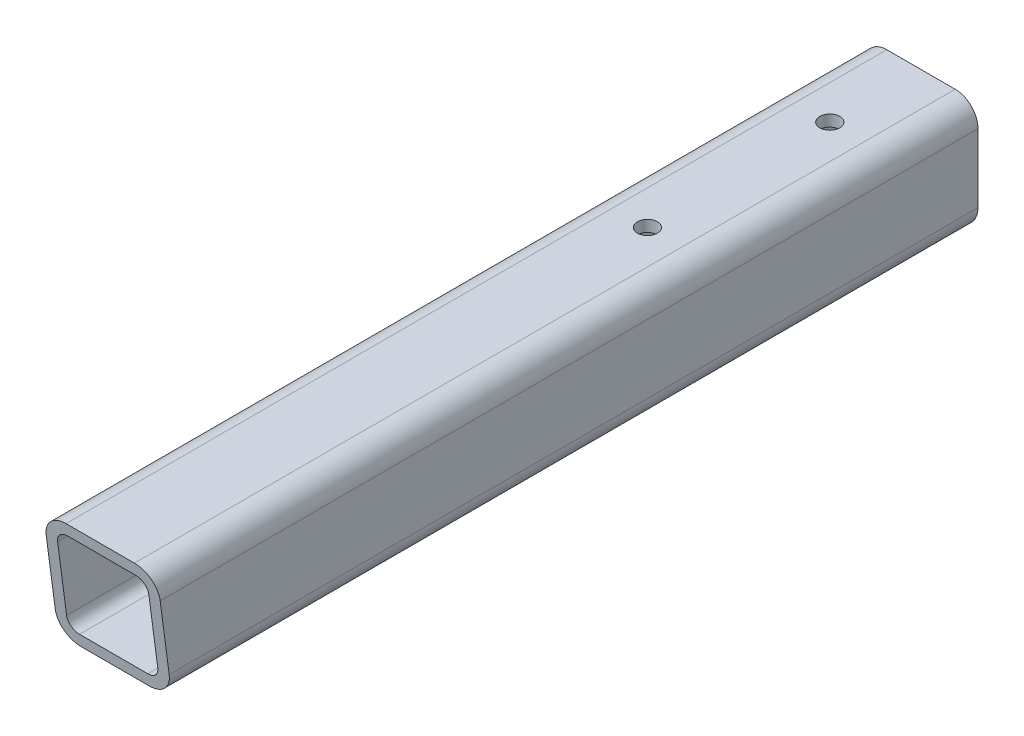
ISO-10303-21;
HEADER;
FILE_DESCRIPTION(('STEP AP214'),'2;1');
FILE_NAME('part.step','',(''),(''),'','','');
FILE_SCHEMA(('AUTOMOTIVE_DESIGN { 1 0 10303 214 1 1 1 1 }'));
ENDSEC;
DATA;
#1=APPLICATION_CONTEXT('core data for automotive mechanical design processes');
#2=APPLICATION_PROTOCOL_DEFINITION('international standard','automotive_design',2000,#1);
#3=PRODUCT_CONTEXT('',#1,'mechanical');
#4=PRODUCT('Part','Part','',(#3));
#5=PRODUCT_RELATED_PRODUCT_CATEGORY('part','',(#4));
#6=PRODUCT_DEFINITION_FORMATION('','',#4);
#7=PRODUCT_DEFINITION_CONTEXT('part definition',#1,'design');
#8=PRODUCT_DEFINITION('design','',#6,#7);
#9=PRODUCT_DEFINITION_SHAPE('','',#8);
#10=(LENGTH_UNIT() NAMED_UNIT(*) SI_UNIT(.MILLI.,.METRE.));
#11=(NAMED_UNIT(*) PLANE_ANGLE_UNIT() SI_UNIT($,.RADIAN.));
#12=(NAMED_UNIT(*) SI_UNIT($,.STERADIAN.) SOLID_ANGLE_UNIT());
#13=UNCERTAINTY_MEASURE_WITH_UNIT(LENGTH_MEASURE(1.E-05),#10,'distance_accuracy_value','');
#14=(GEOMETRIC_REPRESENTATION_CONTEXT(3) GLOBAL_UNCERTAINTY_ASSIGNED_CONTEXT((#13)) GLOBAL_UNIT_ASSIGNED_CONTEXT((#10,
#11,#12)) REPRESENTATION_CONTEXT('',''));
#15=CARTESIAN_POINT('',(0.,0.,0.));
#16=DIRECTION('',(0.,0.,1.));
#17=DIRECTION('',(1.,0.,0.));
#18=AXIS2_PLACEMENT_3D('',#15,#16,#17);
#19=CARTESIAN_POINT('',(0.,31.75,228.6));
#20=DIRECTION('',(0.,-1.,0.));
#21=DIRECTION('',(1.,0.,0.));
#22=AXIS2_PLACEMENT_3D('',#19,#20,#21);
#23=PLANE('',#22);
#24=CARTESIAN_POINT('',(0.,31.75,-76.2));
#25=DIRECTION('',(0.,1.,0.));
#26=DIRECTION('',(-1.,0.,0.));
#27=AXIS2_PLACEMENT_3D('',#24,#25,#26);
#28=CIRCLE('',#27,5.55625);
#29=CARTESIAN_POINT('',(-5.55625000000002,31.75,-76.2));
#30=VERTEX_POINT('',#29);
#31=EDGE_CURVE('E325',#30,#30,#28,.T.);
#32=ORIENTED_EDGE('',*,*,#31,.F.);
#33=EDGE_LOOP('',(#32));
#34=FACE_BOUND('',#33,.T.);
#35=CARTESIAN_POINT('',(0.,31.75,-177.8));
#36=DIRECTION('',(0.,1.,0.));
#37=DIRECTION('',(-1.,0.,0.));
#38=AXIS2_PLACEMENT_3D('',#35,#36,#37);
#39=CIRCLE('',#38,5.55625);
#40=CARTESIAN_POINT('',(-5.55625000000002,31.75,-177.8));
#41=VERTEX_POINT('',#40);
#42=EDGE_CURVE('E229',#41,#41,#39,.T.);
#43=ORIENTED_EDGE('',*,*,#42,.F.);
#44=EDGE_LOOP('',(#43));
#45=FACE_BOUND('',#44,.T.);
#46=DIRECTION('',(-1.,0.,0.));
#47=VECTOR('',#46,1.);
#48=CARTESIAN_POINT('',(0.,31.75,-228.6));
#49=LINE('',#48,#47);
#50=CARTESIAN_POINT('',(19.05,31.75,-228.6));
#51=VERTEX_POINT('',#50);
#52=CARTESIAN_POINT('',(-19.05,31.75,-228.6));
#53=VERTEX_POINT('',#52);
#54=EDGE_CURVE('E161',#51,#53,#49,.T.);
#55=ORIENTED_EDGE('',*,*,#54,.T.);
#56=DIRECTION('',(0.,0.,-1.));
#57=VECTOR('',#56,1.);
#58=CARTESIAN_POINT('',(-19.05,31.75,228.6));
#59=LINE('',#58,#57);
#60=CARTESIAN_POINT('',(-19.05,31.75,228.6));
#61=VERTEX_POINT('',#60);
#62=EDGE_CURVE('E11',#61,#53,#59,.T.);
#63=ORIENTED_EDGE('',*,*,#62,.F.);
#64=DIRECTION('',(-1.,0.,0.));
#65=VECTOR('',#64,1.);
#66=CARTESIAN_POINT('',(0.,31.75,228.6));
#67=LINE('',#66,#65);
#68=CARTESIAN_POINT('',(19.05,31.75,228.6));
#69=VERTEX_POINT('',#68);
#70=EDGE_CURVE('E163',#69,#61,#67,.T.);
#71=ORIENTED_EDGE('',*,*,#70,.F.);
#72=DIRECTION('',(0.,0.,-1.));
#73=VECTOR('',#72,1.);
#74=CARTESIAN_POINT('',(19.05,31.75,228.6));
#75=LINE('',#74,#73);
#76=EDGE_CURVE('E152',#69,#51,#75,.T.);
#77=ORIENTED_EDGE('',*,*,#76,.T.);
#78=EDGE_LOOP('',(#55,#63,#71,#77));
#79=FACE_BOUND('',#78,.T.);
#80=ADVANCED_FACE('F39',(#34,#45,#79),#23,.F.);
#81=CARTESIAN_POINT('',(-19.05,19.05,228.6));
#82=DIRECTION('',(0.,0.,-1.));
#83=DIRECTION('',(-1.,0.,0.));
#84=AXIS2_PLACEMENT_3D('',#81,#82,#83);
#85=CYLINDRICAL_SURFACE('',#84,12.7);
#86=DIRECTION('',(0.,0.,-1.));
#87=VECTOR('',#86,1.);
#88=CARTESIAN_POINT('',(-31.75,19.05,228.6));
#89=LINE('',#88,#87);
#90=CARTESIAN_POINT('',(-31.75,19.05,226.92801328064));
#91=VERTEX_POINT('',#90);
#92=CARTESIAN_POINT('',(-31.75,19.05,-228.6));
#93=VERTEX_POINT('',#92);
#94=EDGE_CURVE('E49',#91,#93,#89,.T.);
#95=ORIENTED_EDGE('',*,*,#94,.F.);
#96=CARTESIAN_POINT('',(-19.05,19.05,226.92801328064));
#97=DIRECTION('',(0.,0.130526192220045,-0.991444861373811));
#98=DIRECTION('',(0.,-0.991444861373811,-0.130526192220045));
#99=AXIS2_PLACEMENT_3D('',#96,#97,#98);
#100=ELLIPSE('',#99,12.8095877993679,12.7);
#101=EDGE_CURVE('E321',#91,#61,#100,.T.);
#102=ORIENTED_EDGE('',*,*,#101,.T.);
#103=ORIENTED_EDGE('',*,*,#62,.T.);
#104=CARTESIAN_POINT('',(-19.05,19.05,-228.6));
#105=DIRECTION('',(0.,0.,1.));
#106=DIRECTION('',(1.,0.,0.));
#107=AXIS2_PLACEMENT_3D('',#104,#105,#106);
#108=CIRCLE('',#107,12.7);
#109=EDGE_CURVE('E274',#53,#93,#108,.T.);
#110=ORIENTED_EDGE('',*,*,#109,.T.);
#111=EDGE_LOOP('',(#95,#102,#103,#110));
#112=FACE_BOUND('',#111,.T.);
#113=ADVANCED_FACE('F338',(#112),#85,.T.);
#114=CARTESIAN_POINT('',(-31.7499999999999,-69.9914213562374,228.6));
#115=DIRECTION('',(-1.,0.,0.));
#116=DIRECTION('',(0.,-1.,0.));
#117=AXIS2_PLACEMENT_3D('',#114,#115,#116);
#118=PLANE('',#117);
#119=DIRECTION('',(0.,0.991444861373811,0.130526192220045));
#120=VECTOR('',#119,1.);
#121=CARTESIAN_POINT('',(-31.75,-79.6431672095347,213.934811322695));
#122=LINE('',#121,#120);
#123=CARTESIAN_POINT('',(-31.75,-19.05,221.912053122561));
#124=VERTEX_POINT('',#123);
#125=EDGE_CURVE('E362',#124,#91,#122,.T.);
#126=ORIENTED_EDGE('',*,*,#125,.T.);
#127=ORIENTED_EDGE('',*,*,#94,.T.);
#128=DIRECTION('',(0.,1.,0.));
#129=VECTOR('',#128,1.);
#130=CARTESIAN_POINT('',(-31.7499999999999,-69.9914213562374,-228.6));
#131=LINE('',#130,#129);
#132=CARTESIAN_POINT('',(-31.75,-19.05,-228.6));
#133=VERTEX_POINT('',#132);
#134=EDGE_CURVE('E278',#133,#93,#131,.T.);
#135=ORIENTED_EDGE('',*,*,#134,.F.);
#136=DIRECTION('',(0.,0.,-1.));
#137=VECTOR('',#136,1.);
#138=CARTESIAN_POINT('',(-31.75,-19.05,228.6));
#139=LINE('',#138,#137);
#140=EDGE_CURVE('E189',#124,#133,#139,.T.);
#141=ORIENTED_EDGE('',*,*,#140,.F.);
#142=EDGE_LOOP('',(#126,#127,#135,#141));
#143=FACE_BOUND('',#142,.T.);
#144=ADVANCED_FACE('F360',(#143),#118,.T.);
#145=CARTESIAN_POINT('',(-19.05,-19.05,228.6));
#146=DIRECTION('',(0.,0.,-1.));
#147=DIRECTION('',(-1.,0.,0.));
#148=AXIS2_PLACEMENT_3D('',#145,#146,#147);
#149=CYLINDRICAL_SURFACE('',#148,12.7);
#150=DIRECTION('',(0.,0.,-1.));
#151=VECTOR('',#150,1.);
#152=CARTESIAN_POINT('',(-19.05,-31.75,228.6));
#153=LINE('',#152,#151);
#154=CARTESIAN_POINT('',(-19.05,-31.75,220.240066403201));
#155=VERTEX_POINT('',#154);
#156=CARTESIAN_POINT('',(-19.05,-31.75,-228.6));
#157=VERTEX_POINT('',#156);
#158=EDGE_CURVE('E186',#155,#157,#153,.T.);
#159=ORIENTED_EDGE('',*,*,#158,.F.);
#160=CARTESIAN_POINT('',(-19.05,-19.05,221.912053122561));
#161=DIRECTION('',(0.,0.130526192220045,-0.991444861373811));
#162=DIRECTION('',(0.,-0.991444861373811,-0.130526192220045));
#163=AXIS2_PLACEMENT_3D('',#160,#161,#162);
#164=ELLIPSE('',#163,12.8095877993679,12.7);
#165=EDGE_CURVE('E311',#155,#124,#164,.T.);
#166=ORIENTED_EDGE('',*,*,#165,.T.);
#167=ORIENTED_EDGE('',*,*,#140,.T.);
#168=CARTESIAN_POINT('',(-19.05,-19.05,-228.6));
#169=DIRECTION('',(0.,0.,1.));
#170=DIRECTION('',(1.,0.,0.));
#171=AXIS2_PLACEMENT_3D('',#168,#169,#170);
#172=CIRCLE('',#171,12.7);
#173=EDGE_CURVE('E282',#133,#157,#172,.T.);
#174=ORIENTED_EDGE('',*,*,#173,.T.);
#175=EDGE_LOOP('',(#159,#166,#167,#174));
#176=FACE_BOUND('',#175,.T.);
#177=ADVANCED_FACE('F454',(#176),#149,.T.);
#178=CARTESIAN_POINT('',(0.,-31.75,228.6));
#179=DIRECTION('',(0.,1.,0.));
#180=DIRECTION('',(-1.,0.,0.));
#181=AXIS2_PLACEMENT_3D('',#178,#179,#180);
#182=PLANE('',#181);
#183=CARTESIAN_POINT('',(0.,-31.75,-76.2));
#184=DIRECTION('',(0.,1.,0.));
#185=DIRECTION('',(-1.,0.,0.));
#186=AXIS2_PLACEMENT_3D('',#183,#184,#185);
#187=CIRCLE('',#186,5.55625);
#188=CARTESIAN_POINT('',(-5.55624999999998,-31.75,-76.2));
#189=VERTEX_POINT('',#188);
#190=EDGE_CURVE('E326',#189,#189,#187,.T.);
#191=ORIENTED_EDGE('',*,*,#190,.T.);
#192=EDGE_LOOP('',(#191));
#193=FACE_BOUND('',#192,.T.);
#194=CARTESIAN_POINT('',(0.,-31.75,-177.8));
#195=DIRECTION('',(0.,1.,0.));
#196=DIRECTION('',(-1.,0.,0.));
#197=AXIS2_PLACEMENT_3D('',#194,#195,#196);
#198=CIRCLE('',#197,5.55625);
#199=CARTESIAN_POINT('',(-5.55624999999998,-31.75,-177.8));
#200=VERTEX_POINT('',#199);
#201=EDGE_CURVE('E220',#200,#200,#198,.T.);
#202=ORIENTED_EDGE('',*,*,#201,.T.);
#203=EDGE_LOOP('',(#202));
#204=FACE_BOUND('',#203,.T.);
#205=DIRECTION('',(0.,0.,-1.));
#206=VECTOR('',#205,1.);
#207=CARTESIAN_POINT('',(19.05,-31.75,228.6));
#208=LINE('',#207,#206);
#209=CARTESIAN_POINT('',(19.05,-31.75,220.240066403201));
#210=VERTEX_POINT('',#209);
#211=CARTESIAN_POINT('',(19.05,-31.75,-228.6));
#212=VERTEX_POINT('',#211);
#213=EDGE_CURVE('E183',#210,#212,#208,.T.);
#214=ORIENTED_EDGE('',*,*,#213,.F.);
#215=DIRECTION('',(-1.,0.,0.));
#216=VECTOR('',#215,1.);
#217=CARTESIAN_POINT('',(0.,-31.75,220.240066403201));
#218=LINE('',#217,#216);
#219=EDGE_CURVE('E306',#210,#155,#218,.T.);
#220=ORIENTED_EDGE('',*,*,#219,.T.);
#221=ORIENTED_EDGE('',*,*,#158,.T.);
#222=DIRECTION('',(1.,0.,0.));
#223=VECTOR('',#222,1.);
#224=CARTESIAN_POINT('',(0.,-31.75,-228.6));
#225=LINE('',#224,#223);
#226=EDGE_CURVE('E174',#157,#212,#225,.T.);
#227=ORIENTED_EDGE('',*,*,#226,.T.);
#228=EDGE_LOOP('',(#214,#220,#221,#227));
#229=FACE_BOUND('',#228,.T.);
#230=ADVANCED_FACE('F291',(#193,#204,#229),#182,.F.);
#231=CARTESIAN_POINT('',(19.05,-19.05,228.6));
#232=DIRECTION('',(0.,0.,-1.));
#233=DIRECTION('',(-1.,0.,0.));
#234=AXIS2_PLACEMENT_3D('',#231,#232,#233);
#235=CYLINDRICAL_SURFACE('',#234,12.7);
#236=DIRECTION('',(0.,0.,-1.));
#237=VECTOR('',#236,1.);
#238=CARTESIAN_POINT('',(31.75,-19.05,228.6));
#239=LINE('',#238,#237);
#240=CARTESIAN_POINT('',(31.75,-19.05,221.912053122561));
#241=VERTEX_POINT('',#240);
#242=CARTESIAN_POINT('',(31.75,-19.05,-228.6));
#243=VERTEX_POINT('',#242);
#244=EDGE_CURVE('E151',#241,#243,#239,.T.);
#245=ORIENTED_EDGE('',*,*,#244,.F.);
#246=CARTESIAN_POINT('',(19.05,-19.05,221.912053122561));
#247=DIRECTION('',(0.,0.130526192220045,-0.991444861373811));
#248=DIRECTION('',(0.,-0.991444861373811,-0.130526192220045));
#249=AXIS2_PLACEMENT_3D('',#246,#247,#248);
#250=ELLIPSE('',#249,12.8095877993679,12.7);
#251=EDGE_CURVE('E301',#241,#210,#250,.T.);
#252=ORIENTED_EDGE('',*,*,#251,.T.);
#253=ORIENTED_EDGE('',*,*,#213,.T.);
#254=CARTESIAN_POINT('',(19.05,-19.05,-228.6));
#255=DIRECTION('',(0.,0.,1.));
#256=DIRECTION('',(1.,0.,0.));
#257=AXIS2_PLACEMENT_3D('',#254,#255,#256);
#258=CIRCLE('',#257,12.7);
#259=EDGE_CURVE('E169',#212,#243,#258,.T.);
#260=ORIENTED_EDGE('',*,*,#259,.T.);
#261=EDGE_LOOP('',(#245,#252,#253,#260));
#262=FACE_BOUND('',#261,.T.);
#263=ADVANCED_FACE('F297',(#262),#235,.T.);
#264=CARTESIAN_POINT('',(31.7500000000001,-69.9914213562373,228.6));
#265=DIRECTION('',(1.,0.,0.));
#266=DIRECTION('',(0.,1.,0.));
#267=AXIS2_PLACEMENT_3D('',#264,#265,#266);
#268=PLANE('',#267);
#269=DIRECTION('',(0.,0.991444861373811,0.130526192220045));
#270=VECTOR('',#269,1.);
#271=CARTESIAN_POINT('',(31.7500000000001,-79.6431672095347,213.934811322695));
#272=LINE('',#271,#270);
#273=CARTESIAN_POINT('',(31.75,19.05,226.92801328064));
#274=VERTEX_POINT('',#273);
#275=EDGE_CURVE('E365',#241,#274,#272,.T.);
#276=ORIENTED_EDGE('',*,*,#275,.F.);
#277=ORIENTED_EDGE('',*,*,#244,.T.);
#278=DIRECTION('',(0.,-1.,0.));
#279=VECTOR('',#278,1.);
#280=CARTESIAN_POINT('',(31.7500000000001,-69.9914213562373,-228.6));
#281=LINE('',#280,#279);
#282=CARTESIAN_POINT('',(31.75,19.05,-228.6));
#283=VERTEX_POINT('',#282);
#284=EDGE_CURVE('E159',#283,#243,#281,.T.);
#285=ORIENTED_EDGE('',*,*,#284,.F.);
#286=DIRECTION('',(0.,0.,-1.));
#287=VECTOR('',#286,1.);
#288=CARTESIAN_POINT('',(31.75,19.05,228.6));
#289=LINE('',#288,#287);
#290=EDGE_CURVE('E141',#274,#283,#289,.T.);
#291=ORIENTED_EDGE('',*,*,#290,.F.);
#292=EDGE_LOOP('',(#276,#277,#285,#291));
#293=FACE_BOUND('',#292,.T.);
#294=ADVANCED_FACE('F165',(#293),#268,.T.);
#295=CARTESIAN_POINT('',(-19.05,-19.05,228.6));
#296=DIRECTION('',(0.,0.,-1.));
#297=DIRECTION('',(-1.,0.,0.));
#298=AXIS2_PLACEMENT_3D('',#295,#296,#297);
#299=CYLINDRICAL_SURFACE('',#298,6.34999999999999);
#300=CARTESIAN_POINT('',(-19.05,-19.05,221.912053122561));
#301=DIRECTION('',(0.,0.130526192220045,-0.991444861373811));
#302=DIRECTION('',(0.,-0.991444861373811,-0.130526192220045));
#303=AXIS2_PLACEMENT_3D('',#300,#301,#302);
#304=ELLIPSE('',#303,6.40479389968395,6.34999999999999);
#305=CARTESIAN_POINT('',(-19.05,-25.4,221.076059762881));
#306=VERTEX_POINT('',#305);
#307=CARTESIAN_POINT('',(-25.4,-19.05,221.912053122561));
#308=VERTEX_POINT('',#307);
#309=EDGE_CURVE('E307',#306,#308,#304,.T.);
#310=ORIENTED_EDGE('',*,*,#309,.F.);
#311=DIRECTION('',(0.,0.,-1.));
#312=VECTOR('',#311,1.);
#313=CARTESIAN_POINT('',(-19.05,-25.4,228.6));
#314=LINE('',#313,#312);
#315=CARTESIAN_POINT('',(-19.05,-25.4,-228.6));
#316=VERTEX_POINT('',#315);
#317=EDGE_CURVE('E194',#306,#316,#314,.T.);
#318=ORIENTED_EDGE('',*,*,#317,.T.);
#319=CARTESIAN_POINT('',(-19.05,-19.05,-228.6));
#320=DIRECTION('',(0.,0.,1.));
#321=DIRECTION('',(1.,0.,0.));
#322=AXIS2_PLACEMENT_3D('',#319,#320,#321);
#323=CIRCLE('',#322,6.34999999999999);
#324=CARTESIAN_POINT('',(-25.4,-19.05,-228.6));
#325=VERTEX_POINT('',#324);
#326=EDGE_CURVE('E225',#325,#316,#323,.T.);
#327=ORIENTED_EDGE('',*,*,#326,.F.);
#328=DIRECTION('',(0.,0.,-1.));
#329=VECTOR('',#328,1.);
#330=CARTESIAN_POINT('',(-25.4,-19.05,228.6));
#331=LINE('',#330,#329);
#332=EDGE_CURVE('E179',#308,#325,#331,.T.);
#333=ORIENTED_EDGE('',*,*,#332,.F.);
#334=EDGE_LOOP('',(#310,#318,#327,#333));
#335=FACE_BOUND('',#334,.T.);
#336=ADVANCED_FACE('F41',(#335),#299,.F.);
#337=CARTESIAN_POINT('',(-25.3999999999999,-69.9914213562373,228.6));
#338=DIRECTION('',(-1.,0.,0.));
#339=DIRECTION('',(0.,-1.,0.));
#340=AXIS2_PLACEMENT_3D('',#337,#338,#339);
#341=PLANE('',#340);
#342=DIRECTION('',(0.,0.,-1.));
#343=VECTOR('',#342,1.);
#344=CARTESIAN_POINT('',(-25.4,19.05,228.6));
#345=LINE('',#344,#343);
#346=CARTESIAN_POINT('',(-25.4,19.05,226.92801328064));
#347=VERTEX_POINT('',#346);
#348=CARTESIAN_POINT('',(-25.4,19.05,-228.6));
#349=VERTEX_POINT('',#348);
#350=EDGE_CURVE('E212',#347,#349,#345,.T.);
#351=ORIENTED_EDGE('',*,*,#350,.F.);
#352=DIRECTION('',(0.,-0.991444861373811,-0.130526192220045));
#353=VECTOR('',#352,1.);
#354=CARTESIAN_POINT('',(-25.3999999999999,-68.2580439237928,215.433691238603));
#355=LINE('',#354,#353);
#356=EDGE_CURVE('E314',#347,#308,#355,.T.);
#357=ORIENTED_EDGE('',*,*,#356,.T.);
#358=ORIENTED_EDGE('',*,*,#332,.T.);
#359=DIRECTION('',(0.,1.,0.));
#360=VECTOR('',#359,1.);
#361=CARTESIAN_POINT('',(-25.3999999999999,-69.9914213562373,-228.6));
#362=LINE('',#361,#360);
#363=EDGE_CURVE('E245',#325,#349,#362,.T.);
#364=ORIENTED_EDGE('',*,*,#363,.T.);
#365=EDGE_LOOP('',(#351,#357,#358,#364));
#366=FACE_BOUND('',#365,.T.);
#367=ADVANCED_FACE('F397',(#366),#341,.F.);
#368=CARTESIAN_POINT('',(-19.05,19.05,228.6));
#369=DIRECTION('',(0.,0.,-1.));
#370=DIRECTION('',(-1.,0.,0.));
#371=AXIS2_PLACEMENT_3D('',#368,#369,#370);
#372=CYLINDRICAL_SURFACE('',#371,6.34999999999999);
#373=CARTESIAN_POINT('',(-19.05,19.05,226.92801328064));
#374=DIRECTION('',(0.,0.130526192220045,-0.991444861373811));
#375=DIRECTION('',(0.,-0.991444861373811,-0.130526192220045));
#376=AXIS2_PLACEMENT_3D('',#373,#374,#375);
#377=ELLIPSE('',#376,6.40479389968396,6.34999999999999);
#378=CARTESIAN_POINT('',(-19.05,25.4,227.76400664032));
#379=VERTEX_POINT('',#378);
#380=EDGE_CURVE('E388',#347,#379,#377,.T.);
#381=ORIENTED_EDGE('',*,*,#380,.F.);
#382=ORIENTED_EDGE('',*,*,#350,.T.);
#383=CARTESIAN_POINT('',(-19.05,19.05,-228.6));
#384=DIRECTION('',(0.,0.,1.));
#385=DIRECTION('',(1.,0.,0.));
#386=AXIS2_PLACEMENT_3D('',#383,#384,#385);
#387=CIRCLE('',#386,6.34999999999999);
#388=CARTESIAN_POINT('',(-19.05,25.4,-228.6));
#389=VERTEX_POINT('',#388);
#390=EDGE_CURVE('E249',#389,#349,#387,.T.);
#391=ORIENTED_EDGE('',*,*,#390,.F.);
#392=DIRECTION('',(0.,0.,-1.));
#393=VECTOR('',#392,1.);
#394=CARTESIAN_POINT('',(-19.05,25.4,228.6));
#395=LINE('',#394,#393);
#396=EDGE_CURVE('E209',#379,#389,#395,.T.);
#397=ORIENTED_EDGE('',*,*,#396,.F.);
#398=EDGE_LOOP('',(#381,#382,#391,#397));
#399=FACE_BOUND('',#398,.T.);
#400=ADVANCED_FACE('F435',(#399),#372,.F.);
#401=CARTESIAN_POINT('',(0.,25.4,228.6));
#402=DIRECTION('',(0.,-1.,0.));
#403=DIRECTION('',(1.,0.,0.));
#404=AXIS2_PLACEMENT_3D('',#401,#402,#403);
#405=PLANE('',#404);
#406=DIRECTION('',(1.,0.,0.));
#407=VECTOR('',#406,1.);
#408=CARTESIAN_POINT('',(0.,25.4,227.76400664032));
#409=LINE('',#408,#407);
#410=CARTESIAN_POINT('',(19.05,25.4,227.76400664032));
#411=VERTEX_POINT('',#410);
#412=EDGE_CURVE('E384',#379,#411,#409,.T.);
#413=ORIENTED_EDGE('',*,*,#412,.F.);
#414=ORIENTED_EDGE('',*,*,#396,.T.);
#415=DIRECTION('',(-1.,0.,0.));
#416=VECTOR('',#415,1.);
#417=CARTESIAN_POINT('',(0.,25.4,-228.6));
#418=LINE('',#417,#416);
#419=CARTESIAN_POINT('',(19.05,25.4,-228.6));
#420=VERTEX_POINT('',#419);
#421=EDGE_CURVE('E253',#420,#389,#418,.T.);
#422=ORIENTED_EDGE('',*,*,#421,.F.);
#423=DIRECTION('',(0.,0.,-1.));
#424=VECTOR('',#423,1.);
#425=CARTESIAN_POINT('',(19.05,25.4,228.6));
#426=LINE('',#425,#424);
#427=EDGE_CURVE('E206',#411,#420,#426,.T.);
#428=ORIENTED_EDGE('',*,*,#427,.F.);
#429=EDGE_LOOP('',(#413,#414,#422,#428));
#430=FACE_BOUND('',#429,.T.);
#431=CARTESIAN_POINT('',(0.,25.4,-76.2));
#432=DIRECTION('',(0.,-1.,0.));
#433=DIRECTION('',(1.,0.,0.));
#434=AXIS2_PLACEMENT_3D('',#431,#432,#433);
#435=CIRCLE('',#434,5.55625);
#436=CARTESIAN_POINT('',(5.55624999999998,25.4,-76.2));
#437=VERTEX_POINT('',#436);
#438=EDGE_CURVE('E235',#437,#437,#435,.T.);
#439=ORIENTED_EDGE('',*,*,#438,.F.);
#440=EDGE_LOOP('',(#439));
#441=FACE_BOUND('',#440,.T.);
#442=CARTESIAN_POINT('',(0.,25.4,-177.8));
#443=DIRECTION('',(0.,-1.,0.));
#444=DIRECTION('',(1.,0.,0.));
#445=AXIS2_PLACEMENT_3D('',#442,#443,#444);
#446=CIRCLE('',#445,5.55625);
#447=CARTESIAN_POINT('',(5.55624999999998,25.4,-177.8));
#448=VERTEX_POINT('',#447);
#449=EDGE_CURVE('E219',#448,#448,#446,.T.);
#450=ORIENTED_EDGE('',*,*,#449,.F.);
#451=EDGE_LOOP('',(#450));
#452=FACE_BOUND('',#451,.T.);
#453=ADVANCED_FACE('F430',(#430,#441,#452),#405,.T.);
#454=CARTESIAN_POINT('',(19.05,19.05,228.6));
#455=DIRECTION('',(0.,0.,-1.));
#456=DIRECTION('',(-1.,0.,0.));
#457=AXIS2_PLACEMENT_3D('',#454,#455,#456);
#458=CYLINDRICAL_SURFACE('',#457,6.34999999999999);
#459=CARTESIAN_POINT('',(19.05,19.05,226.92801328064));
#460=DIRECTION('',(0.,0.130526192220045,-0.991444861373811));
#461=DIRECTION('',(0.,-0.991444861373811,-0.130526192220045));
#462=AXIS2_PLACEMENT_3D('',#459,#460,#461);
#463=ELLIPSE('',#462,6.40479389968396,6.34999999999999);
#464=CARTESIAN_POINT('',(25.4,19.05,226.92801328064));
#465=VERTEX_POINT('',#464);
#466=EDGE_CURVE('E380',#411,#465,#463,.T.);
#467=ORIENTED_EDGE('',*,*,#466,.F.);
#468=ORIENTED_EDGE('',*,*,#427,.T.);
#469=CARTESIAN_POINT('',(19.05,19.05,-228.6));
#470=DIRECTION('',(0.,0.,1.));
#471=DIRECTION('',(1.,0.,0.));
#472=AXIS2_PLACEMENT_3D('',#469,#470,#471);
#473=CIRCLE('',#472,6.34999999999999);
#474=CARTESIAN_POINT('',(25.4,19.05,-228.6));
#475=VERTEX_POINT('',#474);
#476=EDGE_CURVE('E257',#475,#420,#473,.T.);
#477=ORIENTED_EDGE('',*,*,#476,.F.);
#478=DIRECTION('',(0.,0.,-1.));
#479=VECTOR('',#478,1.);
#480=CARTESIAN_POINT('',(25.4,19.05,228.6));
#481=LINE('',#480,#479);
#482=EDGE_CURVE('E203',#465,#475,#481,.T.);
#483=ORIENTED_EDGE('',*,*,#482,.F.);
#484=EDGE_LOOP('',(#467,#468,#477,#483));
#485=FACE_BOUND('',#484,.T.);
#486=ADVANCED_FACE('F423',(#485),#458,.F.);
#487=CARTESIAN_POINT('',(25.4,-69.9914213562373,228.6));
#488=DIRECTION('',(1.,0.,0.));
#489=DIRECTION('',(0.,0.,-1.));
#490=AXIS2_PLACEMENT_3D('',#487,#488,#489);
#491=PLANE('',#490);
#492=DIRECTION('',(0.,0.,-1.));
#493=VECTOR('',#492,1.);
#494=CARTESIAN_POINT('',(25.4,-19.05,228.6));
#495=LINE('',#494,#493);
#496=CARTESIAN_POINT('',(25.4,-19.05,221.912053122561));
#497=VERTEX_POINT('',#496);
#498=CARTESIAN_POINT('',(25.4,-19.05,-228.6));
#499=VERTEX_POINT('',#498);
#500=EDGE_CURVE('E200',#497,#499,#495,.T.);
#501=ORIENTED_EDGE('',*,*,#500,.F.);
#502=DIRECTION('',(0.,0.991444861373811,0.130526192220045));
#503=VECTOR('',#502,1.);
#504=CARTESIAN_POINT('',(25.4,-68.2580439237928,215.433691238603));
#505=LINE('',#504,#503);
#506=EDGE_CURVE('E377',#497,#465,#505,.T.);
#507=ORIENTED_EDGE('',*,*,#506,.T.);
#508=ORIENTED_EDGE('',*,*,#482,.T.);
#509=DIRECTION('',(0.,-1.,0.));
#510=VECTOR('',#509,1.);
#511=CARTESIAN_POINT('',(25.4,-69.9914213562373,-228.6));
#512=LINE('',#511,#510);
#513=EDGE_CURVE('E261',#475,#499,#512,.T.);
#514=ORIENTED_EDGE('',*,*,#513,.T.);
#515=EDGE_LOOP('',(#501,#507,#508,#514));
#516=FACE_BOUND('',#515,.T.);
#517=ADVANCED_FACE('F472',(#516),#491,.F.);
#518=CARTESIAN_POINT('',(19.05,-19.05,228.6));
#519=DIRECTION('',(0.,0.,-1.));
#520=DIRECTION('',(-1.,0.,0.));
#521=AXIS2_PLACEMENT_3D('',#518,#519,#520);
#522=CYLINDRICAL_SURFACE('',#521,6.34999999999999);
#523=CARTESIAN_POINT('',(19.05,-19.05,221.912053122561));
#524=DIRECTION('',(0.,0.130526192220045,-0.991444861373811));
#525=DIRECTION('',(0.,-0.991444861373811,-0.130526192220045));
#526=AXIS2_PLACEMENT_3D('',#523,#524,#525);
#527=ELLIPSE('',#526,6.40479389968396,6.34999999999999);
#528=CARTESIAN_POINT('',(19.05,-25.4,221.076059762881));
#529=VERTEX_POINT('',#528);
#530=EDGE_CURVE('E60',#497,#529,#527,.T.);
#531=ORIENTED_EDGE('',*,*,#530,.F.);
#532=ORIENTED_EDGE('',*,*,#500,.T.);
#533=CARTESIAN_POINT('',(19.05,-19.05,-228.6));
#534=DIRECTION('',(0.,0.,1.));
#535=DIRECTION('',(1.,0.,0.));
#536=AXIS2_PLACEMENT_3D('',#533,#534,#535);
#537=CIRCLE('',#536,6.34999999999999);
#538=CARTESIAN_POINT('',(19.05,-25.4,-228.6));
#539=VERTEX_POINT('',#538);
#540=EDGE_CURVE('E265',#539,#499,#537,.T.);
#541=ORIENTED_EDGE('',*,*,#540,.F.);
#542=DIRECTION('',(0.,0.,-1.));
#543=VECTOR('',#542,1.);
#544=CARTESIAN_POINT('',(19.05,-25.4,228.6));
#545=LINE('',#544,#543);
#546=EDGE_CURVE('E197',#529,#539,#545,.T.);
#547=ORIENTED_EDGE('',*,*,#546,.F.);
#548=EDGE_LOOP('',(#531,#532,#541,#547));
#549=FACE_BOUND('',#548,.T.);
#550=ADVANCED_FACE('F415',(#549),#522,.F.);
#551=CARTESIAN_POINT('',(0.,-25.4,228.6));
#552=DIRECTION('',(0.,1.,0.));
#553=DIRECTION('',(-1.,0.,0.));
#554=AXIS2_PLACEMENT_3D('',#551,#552,#553);
#555=PLANE('',#554);
#556=DIRECTION('',(-1.,0.,0.));
#557=VECTOR('',#556,1.);
#558=CARTESIAN_POINT('',(0.,-25.4,221.076059762881));
#559=LINE('',#558,#557);
#560=EDGE_CURVE('E368',#529,#306,#559,.T.);
#561=ORIENTED_EDGE('',*,*,#560,.F.);
#562=ORIENTED_EDGE('',*,*,#546,.T.);
#563=DIRECTION('',(1.,0.,0.));
#564=VECTOR('',#563,1.);
#565=CARTESIAN_POINT('',(0.,-25.4,-228.6));
#566=LINE('',#565,#564);
#567=EDGE_CURVE('E268',#316,#539,#566,.T.);
#568=ORIENTED_EDGE('',*,*,#567,.F.);
#569=ORIENTED_EDGE('',*,*,#317,.F.);
#570=EDGE_LOOP('',(#561,#562,#568,#569));
#571=FACE_BOUND('',#570,.T.);
#572=CARTESIAN_POINT('',(0.,-25.4,-76.2));
#573=DIRECTION('',(0.,1.,0.));
#574=DIRECTION('',(-1.,0.,0.));
#575=AXIS2_PLACEMENT_3D('',#572,#573,#574);
#576=CIRCLE('',#575,5.55625);
#577=CARTESIAN_POINT('',(-5.55624999999998,-25.4,-76.2));
#578=VERTEX_POINT('',#577);
#579=EDGE_CURVE('E43',#578,#578,#576,.T.);
#580=ORIENTED_EDGE('',*,*,#579,.F.);
#581=EDGE_LOOP('',(#580));
#582=FACE_BOUND('',#581,.T.);
#583=CARTESIAN_POINT('',(0.,-25.4,-177.8));
#584=DIRECTION('',(0.,1.,0.));
#585=DIRECTION('',(-1.,0.,0.));
#586=AXIS2_PLACEMENT_3D('',#583,#584,#585);
#587=CIRCLE('',#586,5.55625);
#588=CARTESIAN_POINT('',(-5.55624999999998,-25.4,-177.8));
#589=VERTEX_POINT('',#588);
#590=EDGE_CURVE('E216',#589,#589,#587,.T.);
#591=ORIENTED_EDGE('',*,*,#590,.F.);
#592=EDGE_LOOP('',(#591));
#593=FACE_BOUND('',#592,.T.);
#594=ADVANCED_FACE('F410',(#571,#582,#593),#555,.T.);
#595=CARTESIAN_POINT('',(19.05,19.05,228.6));
#596=DIRECTION('',(0.,0.,-1.));
#597=DIRECTION('',(-1.,0.,0.));
#598=AXIS2_PLACEMENT_3D('',#595,#596,#597);
#599=CYLINDRICAL_SURFACE('',#598,12.7);
#600=ORIENTED_EDGE('',*,*,#76,.F.);
#601=CARTESIAN_POINT('',(19.05,19.05,226.92801328064));
#602=DIRECTION('',(0.,0.130526192220045,-0.991444861373811));
#603=DIRECTION('',(0.,-0.991444861373811,-0.130526192220045));
#604=AXIS2_PLACEMENT_3D('',#601,#602,#603);
#605=ELLIPSE('',#604,12.8095877993679,12.7);
#606=EDGE_CURVE('E71',#69,#274,#605,.T.);
#607=ORIENTED_EDGE('',*,*,#606,.T.);
#608=ORIENTED_EDGE('',*,*,#290,.T.);
#609=CARTESIAN_POINT('',(19.05,19.05,-228.6));
#610=DIRECTION('',(0.,0.,1.));
#611=DIRECTION('',(1.,0.,0.));
#612=AXIS2_PLACEMENT_3D('',#609,#610,#611);
#613=CIRCLE('',#612,12.7);
#614=EDGE_CURVE('E144',#283,#51,#613,.T.);
#615=ORIENTED_EDGE('',*,*,#614,.T.);
#616=EDGE_LOOP('',(#600,#607,#608,#615));
#617=FACE_BOUND('',#616,.T.);
#618=ADVANCED_FACE('F143',(#617),#599,.T.);
#619=CARTESIAN_POINT('',(0.,-69.9914213562373,-228.6));
#620=DIRECTION('',(0.,0.,1.));
#621=DIRECTION('',(1.,0.,0.));
#622=AXIS2_PLACEMENT_3D('',#619,#620,#621);
#623=PLANE('',#622);
#624=ORIENTED_EDGE('',*,*,#326,.T.);
#625=ORIENTED_EDGE('',*,*,#567,.T.);
#626=ORIENTED_EDGE('',*,*,#540,.T.);
#627=ORIENTED_EDGE('',*,*,#513,.F.);
#628=ORIENTED_EDGE('',*,*,#476,.T.);
#629=ORIENTED_EDGE('',*,*,#421,.T.);
#630=ORIENTED_EDGE('',*,*,#390,.T.);
#631=ORIENTED_EDGE('',*,*,#363,.F.);
#632=EDGE_LOOP('',(#624,#625,#626,#627,#628,#629,#630,#631));
#633=FACE_BOUND('',#632,.T.);
#634=ORIENTED_EDGE('',*,*,#54,.F.);
#635=ORIENTED_EDGE('',*,*,#614,.F.);
#636=ORIENTED_EDGE('',*,*,#284,.T.);
#637=ORIENTED_EDGE('',*,*,#259,.F.);
#638=ORIENTED_EDGE('',*,*,#226,.F.);
#639=ORIENTED_EDGE('',*,*,#173,.F.);
#640=ORIENTED_EDGE('',*,*,#134,.T.);
#641=ORIENTED_EDGE('',*,*,#109,.F.);
#642=EDGE_LOOP('',(#634,#635,#636,#637,#638,#639,#640,#641));
#643=FACE_BOUND('',#642,.T.);
#644=ADVANCED_FACE('F157',(#633,#643),#623,.F.);
#645=CARTESIAN_POINT('',(0.,-31.75,-177.8));
#646=DIRECTION('',(0.,1.,0.));
#647=DIRECTION('',(-1.,0.,0.));
#648=AXIS2_PLACEMENT_3D('',#645,#646,#647);
#649=CYLINDRICAL_SURFACE('',#648,5.55625);
#650=ORIENTED_EDGE('',*,*,#590,.T.);
#651=EDGE_LOOP('',(#650));
#652=FACE_BOUND('',#651,.T.);
#653=ORIENTED_EDGE('',*,*,#201,.F.);
#654=EDGE_LOOP('',(#653));
#655=FACE_BOUND('',#654,.T.);
#656=ADVANCED_FACE('F496',(#652,#655),#649,.F.);
#657=ORIENTED_EDGE('',*,*,#449,.T.);
#658=EDGE_LOOP('',(#657));
#659=FACE_BOUND('',#658,.T.);
#660=ORIENTED_EDGE('',*,*,#42,.T.);
#661=EDGE_LOOP('',(#660));
#662=FACE_BOUND('',#661,.T.);
#663=ADVANCED_FACE('F499',(#659,#662),#649,.F.);
#664=CARTESIAN_POINT('',(0.,-31.75,-76.2));
#665=DIRECTION('',(0.,1.,0.));
#666=DIRECTION('',(-1.,0.,0.));
#667=AXIS2_PLACEMENT_3D('',#664,#665,#666);
#668=CYLINDRICAL_SURFACE('',#667,5.55625);
#669=ORIENTED_EDGE('',*,*,#579,.T.);
#670=EDGE_LOOP('',(#669));
#671=FACE_BOUND('',#670,.T.);
#672=ORIENTED_EDGE('',*,*,#190,.F.);
#673=EDGE_LOOP('',(#672));
#674=FACE_BOUND('',#673,.T.);
#675=ADVANCED_FACE('F500',(#671,#674),#668,.F.);
#676=ORIENTED_EDGE('',*,*,#438,.T.);
#677=EDGE_LOOP('',(#676));
#678=FACE_BOUND('',#677,.T.);
#679=ORIENTED_EDGE('',*,*,#31,.T.);
#680=EDGE_LOOP('',(#679));
#681=FACE_BOUND('',#680,.T.);
#682=ADVANCED_FACE('F334',(#678,#681),#668,.F.);
#683=CARTESIAN_POINT('',(-31.75,-79.6431672095347,213.934811322695));
#684=DIRECTION('',(0.,0.130526192220045,-0.991444861373811));
#685=DIRECTION('',(0.,0.991444861373811,0.130526192220045));
#686=AXIS2_PLACEMENT_3D('',#683,#684,#685);
#687=PLANE('',#686);
#688=ORIENTED_EDGE('',*,*,#309,.T.);
#689=ORIENTED_EDGE('',*,*,#356,.F.);
#690=ORIENTED_EDGE('',*,*,#380,.T.);
#691=ORIENTED_EDGE('',*,*,#412,.T.);
#692=ORIENTED_EDGE('',*,*,#466,.T.);
#693=ORIENTED_EDGE('',*,*,#506,.F.);
#694=ORIENTED_EDGE('',*,*,#530,.T.);
#695=ORIENTED_EDGE('',*,*,#560,.T.);
#696=EDGE_LOOP('',(#688,#689,#690,#691,#692,#693,#694,#695));
#697=FACE_BOUND('',#696,.T.);
#698=ORIENTED_EDGE('',*,*,#125,.F.);
#699=ORIENTED_EDGE('',*,*,#165,.F.);
#700=ORIENTED_EDGE('',*,*,#219,.F.);
#701=ORIENTED_EDGE('',*,*,#251,.F.);
#702=ORIENTED_EDGE('',*,*,#275,.T.);
#703=ORIENTED_EDGE('',*,*,#606,.F.);
#704=ORIENTED_EDGE('',*,*,#70,.T.);
#705=ORIENTED_EDGE('',*,*,#101,.F.);
#706=EDGE_LOOP('',(#698,#699,#700,#701,#702,#703,#704,#705));
#707=FACE_BOUND('',#706,.T.);
#708=ADVANCED_FACE('F347',(#697,#707),#687,.F.);
#709=CLOSED_SHELL('',(#80,#113,#144,#177,#230,#263,#294,#336,#367,#400,#453,#486,#517,#550,#594,
#618,#644,#656,#663,#675,#682,#708));
#710=MANIFOLD_SOLID_BREP('B2',#709);
#711=ADVANCED_BREP_SHAPE_REPRESENTATION('',(#18,#710),#14);
#712=SHAPE_DEFINITION_REPRESENTATION(#9,#711);
ENDSEC;
END-ISO-10303-21;
